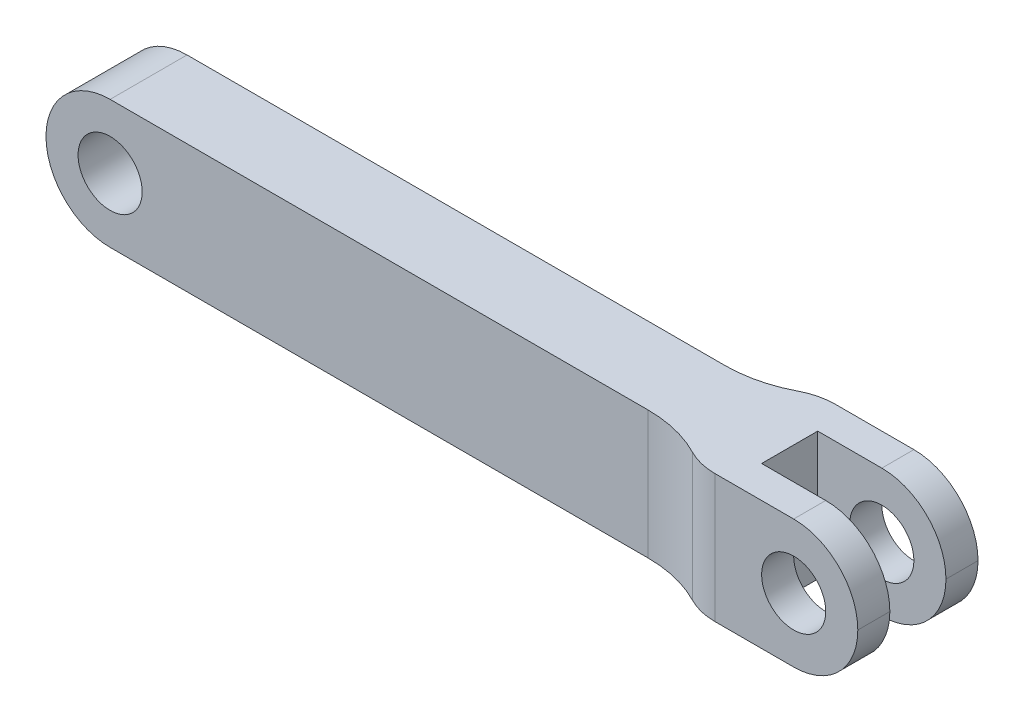
ISO-10303-21;
HEADER;
FILE_DESCRIPTION(('STEP AP214'),'2;1');
FILE_NAME('part.step','',(''),(''),'','','');
FILE_SCHEMA(('AUTOMOTIVE_DESIGN { 1 0 10303 214 1 1 1 1 }'));
ENDSEC;
DATA;
#1=APPLICATION_CONTEXT('core data for automotive mechanical design processes');
#2=APPLICATION_PROTOCOL_DEFINITION('international standard','automotive_design',2000,#1);
#3=PRODUCT_CONTEXT('',#1,'mechanical');
#4=PRODUCT('Part','Part','',(#3));
#5=PRODUCT_RELATED_PRODUCT_CATEGORY('part','',(#4));
#6=PRODUCT_DEFINITION_FORMATION('','',#4);
#7=PRODUCT_DEFINITION_CONTEXT('part definition',#1,'design');
#8=PRODUCT_DEFINITION('design','',#6,#7);
#9=PRODUCT_DEFINITION_SHAPE('','',#8);
#10=(LENGTH_UNIT() NAMED_UNIT(*) SI_UNIT(.MILLI.,.METRE.));
#11=(NAMED_UNIT(*) PLANE_ANGLE_UNIT() SI_UNIT($,.RADIAN.));
#12=(NAMED_UNIT(*) SI_UNIT($,.STERADIAN.) SOLID_ANGLE_UNIT());
#13=UNCERTAINTY_MEASURE_WITH_UNIT(LENGTH_MEASURE(1.E-05),#10,'distance_accuracy_value','');
#14=(GEOMETRIC_REPRESENTATION_CONTEXT(3) GLOBAL_UNCERTAINTY_ASSIGNED_CONTEXT((#13)) GLOBAL_UNIT_ASSIGNED_CONTEXT((#10,
#11,#12)) REPRESENTATION_CONTEXT('',''));
#15=CARTESIAN_POINT('',(0.,0.,0.));
#16=DIRECTION('',(0.,0.,1.));
#17=DIRECTION('',(1.,0.,0.));
#18=AXIS2_PLACEMENT_3D('',#15,#16,#17);
#19=CARTESIAN_POINT('',(0.,0.,12.));
#20=DIRECTION('',(0.,0.,1.));
#21=DIRECTION('',(1.,0.,0.));
#22=AXIS2_PLACEMENT_3D('',#19,#20,#21);
#23=PLANE('',#22);
#24=CARTESIAN_POINT('',(0.,0.,12.));
#25=DIRECTION('',(0.,0.,1.));
#26=DIRECTION('',(1.,0.,0.));
#27=AXIS2_PLACEMENT_3D('',#24,#25,#26);
#28=CIRCLE('',#27,5.);
#29=CARTESIAN_POINT('',(5.,0.,12.));
#30=VERTEX_POINT('',#29);
#31=EDGE_CURVE('E198',#30,#30,#28,.T.);
#32=ORIENTED_EDGE('',*,*,#31,.F.);
#33=EDGE_LOOP('',(#32));
#34=FACE_BOUND('',#33,.T.);
#35=DIRECTION('',(1.,0.,0.));
#36=VECTOR('',#35,1.);
#37=CARTESIAN_POINT('',(0.,-10.,12.));
#38=LINE('',#37,#36);
#39=CARTESIAN_POINT('',(0.,-10.,12.));
#40=VERTEX_POINT('',#39);
#41=CARTESIAN_POINT('',(83.8820246897198,-10.,12.));
#42=VERTEX_POINT('',#41);
#43=EDGE_CURVE('E207',#40,#42,#38,.T.);
#44=ORIENTED_EDGE('',*,*,#43,.T.);
#45=DIRECTION('',(0.,1.,0.));
#46=VECTOR('',#45,1.);
#47=CARTESIAN_POINT('',(83.8820246897198,10.,12.));
#48=LINE('',#47,#46);
#49=CARTESIAN_POINT('',(83.8820246897198,10.,12.));
#50=VERTEX_POINT('',#49);
#51=EDGE_CURVE('E225',#42,#50,#48,.T.);
#52=ORIENTED_EDGE('',*,*,#51,.T.);
#53=DIRECTION('',(-1.,0.,0.));
#54=VECTOR('',#53,1.);
#55=CARTESIAN_POINT('',(0.,10.,12.));
#56=LINE('',#55,#54);
#57=CARTESIAN_POINT('',(0.,10.,12.));
#58=VERTEX_POINT('',#57);
#59=EDGE_CURVE('E211',#50,#58,#56,.T.);
#60=ORIENTED_EDGE('',*,*,#59,.T.);
#61=CARTESIAN_POINT('',(0.,0.,12.));
#62=DIRECTION('',(0.,0.,1.));
#63=DIRECTION('',(1.,0.,0.));
#64=AXIS2_PLACEMENT_3D('',#61,#62,#63);
#65=CIRCLE('',#64,10.);
#66=EDGE_CURVE('E204',#58,#40,#65,.T.);
#67=ORIENTED_EDGE('',*,*,#66,.T.);
#68=EDGE_LOOP('',(#44,#52,#60,#67));
#69=FACE_BOUND('',#68,.T.);
#70=ADVANCED_FACE('F37',(#34,#69),#23,.T.);
#71=CARTESIAN_POINT('',(0.,0.,0.));
#72=DIRECTION('',(0.,0.,1.));
#73=DIRECTION('',(1.,0.,0.));
#74=AXIS2_PLACEMENT_3D('',#71,#72,#73);
#75=PLANE('',#74);
#76=CARTESIAN_POINT('',(0.,0.,0.));
#77=DIRECTION('',(0.,0.,1.));
#78=DIRECTION('',(1.,0.,0.));
#79=AXIS2_PLACEMENT_3D('',#76,#77,#78);
#80=CIRCLE('',#79,5.);
#81=CARTESIAN_POINT('',(5.,0.,0.));
#82=VERTEX_POINT('',#81);
#83=EDGE_CURVE('E197',#82,#82,#80,.T.);
#84=ORIENTED_EDGE('',*,*,#83,.T.);
#85=EDGE_LOOP('',(#84));
#86=FACE_BOUND('',#85,.T.);
#87=DIRECTION('',(-1.,0.,0.));
#88=VECTOR('',#87,1.);
#89=CARTESIAN_POINT('',(0.,10.,0.));
#90=LINE('',#89,#88);
#91=CARTESIAN_POINT('',(83.8820246897198,10.,0.));
#92=VERTEX_POINT('',#91);
#93=CARTESIAN_POINT('',(0.,10.,0.));
#94=VERTEX_POINT('',#93);
#95=EDGE_CURVE('E208',#92,#94,#90,.T.);
#96=ORIENTED_EDGE('',*,*,#95,.F.);
#97=DIRECTION('',(0.,1.,0.));
#98=VECTOR('',#97,1.);
#99=CARTESIAN_POINT('',(83.8820246897198,0.,0.));
#100=LINE('',#99,#98);
#101=CARTESIAN_POINT('',(83.8820246897198,-10.,0.));
#102=VERTEX_POINT('',#101);
#103=EDGE_CURVE('E228',#92,#102,#100,.F.);
#104=ORIENTED_EDGE('',*,*,#103,.T.);
#105=DIRECTION('',(1.,0.,0.));
#106=VECTOR('',#105,1.);
#107=CARTESIAN_POINT('',(0.,-10.,0.));
#108=LINE('',#107,#106);
#109=CARTESIAN_POINT('',(0.,-10.,0.));
#110=VERTEX_POINT('',#109);
#111=EDGE_CURVE('E216',#110,#102,#108,.T.);
#112=ORIENTED_EDGE('',*,*,#111,.F.);
#113=CARTESIAN_POINT('',(0.,0.,0.));
#114=DIRECTION('',(0.,0.,1.));
#115=DIRECTION('',(1.,0.,0.));
#116=AXIS2_PLACEMENT_3D('',#113,#114,#115);
#117=CIRCLE('',#116,10.);
#118=EDGE_CURVE('E201',#94,#110,#117,.T.);
#119=ORIENTED_EDGE('',*,*,#118,.F.);
#120=EDGE_LOOP('',(#96,#104,#112,#119));
#121=FACE_BOUND('',#120,.T.);
#122=ADVANCED_FACE('F323',(#86,#121),#75,.F.);
#123=CARTESIAN_POINT('',(0.,0.,12.));
#124=DIRECTION('',(0.,0.,-1.));
#125=DIRECTION('',(-1.,0.,0.));
#126=AXIS2_PLACEMENT_3D('',#123,#124,#125);
#127=CYLINDRICAL_SURFACE('',#126,10.);
#128=ORIENTED_EDGE('',*,*,#118,.T.);
#129=DIRECTION('',(0.,0.,-1.));
#130=VECTOR('',#129,1.);
#131=CARTESIAN_POINT('',(0.,-10.,12.));
#132=LINE('',#131,#130);
#133=EDGE_CURVE('E163',#40,#110,#132,.T.);
#134=ORIENTED_EDGE('',*,*,#133,.F.);
#135=ORIENTED_EDGE('',*,*,#66,.F.);
#136=DIRECTION('',(0.,0.,-1.));
#137=VECTOR('',#136,1.);
#138=CARTESIAN_POINT('',(0.,10.,12.));
#139=LINE('',#138,#137);
#140=EDGE_CURVE('E213',#58,#94,#139,.T.);
#141=ORIENTED_EDGE('',*,*,#140,.T.);
#142=EDGE_LOOP('',(#128,#134,#135,#141));
#143=FACE_BOUND('',#142,.T.);
#144=ADVANCED_FACE('F328',(#143),#127,.T.);
#145=CARTESIAN_POINT('',(0.,-10.,12.));
#146=DIRECTION('',(0.,1.,0.));
#147=DIRECTION('',(0.,0.,1.));
#148=AXIS2_PLACEMENT_3D('',#145,#146,#147);
#149=PLANE('',#148);
#150=DIRECTION('',(1.,0.,0.));
#151=VECTOR('',#150,1.);
#152=CARTESIAN_POINT('',(95.,-10.,10.375));
#153=LINE('',#152,#151);
#154=CARTESIAN_POINT('',(100.,-10.,10.375));
#155=VERTEX_POINT('',#154);
#156=CARTESIAN_POINT('',(110.,-10.,10.375));
#157=VERTEX_POINT('',#156);
#158=EDGE_CURVE('E156',#155,#157,#153,.T.);
#159=ORIENTED_EDGE('',*,*,#158,.T.);
#160=DIRECTION('',(0.,0.,-1.));
#161=VECTOR('',#160,1.);
#162=CARTESIAN_POINT('',(110.,-10.,15.375));
#163=LINE('',#162,#161);
#164=CARTESIAN_POINT('',(110.,-10.,15.375));
#165=VERTEX_POINT('',#164);
#166=EDGE_CURVE('E263',#157,#165,#163,.F.);
#167=ORIENTED_EDGE('',*,*,#166,.T.);
#168=DIRECTION('',(1.,0.,0.));
#169=VECTOR('',#168,1.);
#170=CARTESIAN_POINT('',(95.,-10.,15.375));
#171=LINE('',#170,#169);
#172=CARTESIAN_POINT('',(97.7062561330949,-10.,15.375));
#173=VERTEX_POINT('',#172);
#174=EDGE_CURVE('E177',#173,#165,#171,.T.);
#175=ORIENTED_EDGE('',*,*,#174,.F.);
#176=CARTESIAN_POINT('',(97.7062561330949,-10.,5.375));
#177=DIRECTION('',(0.,1.,0.));
#178=DIRECTION('',(0.,0.,1.));
#179=AXIS2_PLACEMENT_3D('',#176,#177,#178);
#180=CIRCLE('',#179,10.);
#181=CARTESIAN_POINT('',(93.0981789853032,-10.,14.25));
#182=VERTEX_POINT('',#181);
#183=EDGE_CURVE('E245',#173,#182,#180,.F.);
#184=ORIENTED_EDGE('',*,*,#183,.T.);
#185=CARTESIAN_POINT('',(83.8820246897198,-10.,32.));
#186=DIRECTION('',(0.,1.,0.));
#187=DIRECTION('',(0.,0.,1.));
#188=AXIS2_PLACEMENT_3D('',#185,#186,#187);
#189=CIRCLE('',#188,20.);
#190=EDGE_CURVE('E233',#182,#42,#189,.T.);
#191=ORIENTED_EDGE('',*,*,#190,.T.);
#192=ORIENTED_EDGE('',*,*,#43,.F.);
#193=ORIENTED_EDGE('',*,*,#133,.T.);
#194=ORIENTED_EDGE('',*,*,#111,.T.);
#195=CARTESIAN_POINT('',(83.8820246897198,-10.,-20.));
#196=DIRECTION('',(0.,1.,0.));
#197=DIRECTION('',(0.,0.,1.));
#198=AXIS2_PLACEMENT_3D('',#195,#196,#197);
#199=CIRCLE('',#198,20.);
#200=CARTESIAN_POINT('',(93.0981789853032,-10.,-2.25));
#201=VERTEX_POINT('',#200);
#202=EDGE_CURVE('E237',#102,#201,#199,.T.);
#203=ORIENTED_EDGE('',*,*,#202,.T.);
#204=CARTESIAN_POINT('',(97.7062561330949,-10.,6.625));
#205=DIRECTION('',(0.,1.,0.));
#206=DIRECTION('',(0.,0.,1.));
#207=AXIS2_PLACEMENT_3D('',#204,#205,#206);
#208=CIRCLE('',#207,10.);
#209=CARTESIAN_POINT('',(97.7062561330949,-10.,-3.375));
#210=VERTEX_POINT('',#209);
#211=EDGE_CURVE('E243',#201,#210,#208,.F.);
#212=ORIENTED_EDGE('',*,*,#211,.T.);
#213=DIRECTION('',(1.,0.,0.));
#214=VECTOR('',#213,1.);
#215=CARTESIAN_POINT('',(95.,-10.,-3.375));
#216=LINE('',#215,#214);
#217=CARTESIAN_POINT('',(110.,-10.,-3.375));
#218=VERTEX_POINT('',#217);
#219=EDGE_CURVE('E192',#210,#218,#216,.T.);
#220=ORIENTED_EDGE('',*,*,#219,.T.);
#221=DIRECTION('',(0.,0.,-1.));
#222=VECTOR('',#221,1.);
#223=CARTESIAN_POINT('',(110.,-10.,1.625));
#224=LINE('',#223,#222);
#225=CARTESIAN_POINT('',(110.,-10.,1.625));
#226=VERTEX_POINT('',#225);
#227=EDGE_CURVE('E261',#218,#226,#224,.F.);
#228=ORIENTED_EDGE('',*,*,#227,.T.);
#229=DIRECTION('',(1.,0.,0.));
#230=VECTOR('',#229,1.);
#231=CARTESIAN_POINT('',(95.,-10.,1.625));
#232=LINE('',#231,#230);
#233=CARTESIAN_POINT('',(100.,-10.,1.625));
#234=VERTEX_POINT('',#233);
#235=EDGE_CURVE('E159',#234,#226,#232,.T.);
#236=ORIENTED_EDGE('',*,*,#235,.F.);
#237=DIRECTION('',(0.,0.,-1.));
#238=VECTOR('',#237,1.);
#239=CARTESIAN_POINT('',(100.,-10.,12.));
#240=LINE('',#239,#238);
#241=EDGE_CURVE('E151',#155,#234,#240,.T.);
#242=ORIENTED_EDGE('',*,*,#241,.F.);
#243=EDGE_LOOP('',(#159,#167,#175,#184,#191,#192,#193,#194,#203,#212,#220,#228,#236,#242));
#244=FACE_BOUND('',#243,.T.);
#245=ADVANCED_FACE('F153',(#244),#149,.F.);
#246=CARTESIAN_POINT('',(100.,-10.,12.));
#247=DIRECTION('',(-1.,0.,0.));
#248=DIRECTION('',(0.,0.,1.));
#249=AXIS2_PLACEMENT_3D('',#246,#247,#248);
#250=PLANE('',#249);
#251=DIRECTION('',(0.,0.,-1.));
#252=VECTOR('',#251,1.);
#253=CARTESIAN_POINT('',(100.,10.,12.));
#254=LINE('',#253,#252);
#255=CARTESIAN_POINT('',(100.,10.,10.375));
#256=VERTEX_POINT('',#255);
#257=CARTESIAN_POINT('',(100.,10.,1.625));
#258=VERTEX_POINT('',#257);
#259=EDGE_CURVE('E164',#256,#258,#254,.T.);
#260=ORIENTED_EDGE('',*,*,#259,.F.);
#261=DIRECTION('',(0.,-1.,0.));
#262=VECTOR('',#261,1.);
#263=CARTESIAN_POINT('',(100.,-10.,10.375));
#264=LINE('',#263,#262);
#265=EDGE_CURVE('E167',#256,#155,#264,.T.);
#266=ORIENTED_EDGE('',*,*,#265,.T.);
#267=ORIENTED_EDGE('',*,*,#241,.T.);
#268=DIRECTION('',(0.,1.,0.));
#269=VECTOR('',#268,1.);
#270=CARTESIAN_POINT('',(100.,-10.,1.625));
#271=LINE('',#270,#269);
#272=EDGE_CURVE('E189',#234,#258,#271,.T.);
#273=ORIENTED_EDGE('',*,*,#272,.T.);
#274=EDGE_LOOP('',(#260,#266,#267,#273));
#275=FACE_BOUND('',#274,.T.);
#276=ADVANCED_FACE('F168',(#275),#250,.F.);
#277=CARTESIAN_POINT('',(0.,10.,12.));
#278=DIRECTION('',(0.,-1.,0.));
#279=DIRECTION('',(0.,0.,-1.));
#280=AXIS2_PLACEMENT_3D('',#277,#278,#279);
#281=PLANE('',#280);
#282=DIRECTION('',(1.,0.,0.));
#283=VECTOR('',#282,1.);
#284=CARTESIAN_POINT('',(95.,10.,15.375));
#285=LINE('',#284,#283);
#286=CARTESIAN_POINT('',(97.7062561330949,10.,15.375));
#287=VERTEX_POINT('',#286);
#288=CARTESIAN_POINT('',(110.,10.,15.375));
#289=VERTEX_POINT('',#288);
#290=EDGE_CURVE('E172',#287,#289,#285,.T.);
#291=ORIENTED_EDGE('',*,*,#290,.T.);
#292=DIRECTION('',(0.,0.,1.));
#293=VECTOR('',#292,1.);
#294=CARTESIAN_POINT('',(110.,10.,10.375));
#295=LINE('',#294,#293);
#296=CARTESIAN_POINT('',(110.,10.,10.375));
#297=VERTEX_POINT('',#296);
#298=EDGE_CURVE('E271',#289,#297,#295,.F.);
#299=ORIENTED_EDGE('',*,*,#298,.T.);
#300=DIRECTION('',(1.,0.,0.));
#301=VECTOR('',#300,1.);
#302=CARTESIAN_POINT('',(95.,10.,10.375));
#303=LINE('',#302,#301);
#304=EDGE_CURVE('E178',#256,#297,#303,.T.);
#305=ORIENTED_EDGE('',*,*,#304,.F.);
#306=ORIENTED_EDGE('',*,*,#259,.T.);
#307=DIRECTION('',(1.,0.,0.));
#308=VECTOR('',#307,1.);
#309=CARTESIAN_POINT('',(95.,10.,1.625));
#310=LINE('',#309,#308);
#311=CARTESIAN_POINT('',(110.,10.,1.625));
#312=VERTEX_POINT('',#311);
#313=EDGE_CURVE('E186',#258,#312,#310,.T.);
#314=ORIENTED_EDGE('',*,*,#313,.T.);
#315=DIRECTION('',(0.,0.,1.));
#316=VECTOR('',#315,1.);
#317=CARTESIAN_POINT('',(110.,10.,-3.375));
#318=LINE('',#317,#316);
#319=CARTESIAN_POINT('',(110.,10.,-3.375));
#320=VERTEX_POINT('',#319);
#321=EDGE_CURVE('E269',#312,#320,#318,.F.);
#322=ORIENTED_EDGE('',*,*,#321,.T.);
#323=DIRECTION('',(1.,0.,0.));
#324=VECTOR('',#323,1.);
#325=CARTESIAN_POINT('',(95.,10.,-3.375));
#326=LINE('',#325,#324);
#327=CARTESIAN_POINT('',(97.7062561330949,10.,-3.375));
#328=VERTEX_POINT('',#327);
#329=EDGE_CURVE('E190',#328,#320,#326,.T.);
#330=ORIENTED_EDGE('',*,*,#329,.F.);
#331=CARTESIAN_POINT('',(97.7062561330949,10.,6.625));
#332=DIRECTION('',(0.,-1.,0.));
#333=DIRECTION('',(0.,0.,-1.));
#334=AXIS2_PLACEMENT_3D('',#331,#332,#333);
#335=CIRCLE('',#334,10.);
#336=CARTESIAN_POINT('',(93.0981789853032,10.,-2.25));
#337=VERTEX_POINT('',#336);
#338=EDGE_CURVE('E249',#328,#337,#335,.F.);
#339=ORIENTED_EDGE('',*,*,#338,.T.);
#340=CARTESIAN_POINT('',(83.8820246897198,10.,-20.));
#341=DIRECTION('',(0.,-1.,0.));
#342=DIRECTION('',(0.,0.,-1.));
#343=AXIS2_PLACEMENT_3D('',#340,#341,#342);
#344=CIRCLE('',#343,20.);
#345=EDGE_CURVE('E235',#337,#92,#344,.T.);
#346=ORIENTED_EDGE('',*,*,#345,.T.);
#347=ORIENTED_EDGE('',*,*,#95,.T.);
#348=ORIENTED_EDGE('',*,*,#140,.F.);
#349=ORIENTED_EDGE('',*,*,#59,.F.);
#350=CARTESIAN_POINT('',(83.8820246897198,10.,32.));
#351=DIRECTION('',(0.,-1.,0.));
#352=DIRECTION('',(0.,0.,-1.));
#353=AXIS2_PLACEMENT_3D('',#350,#351,#352);
#354=CIRCLE('',#353,20.);
#355=CARTESIAN_POINT('',(93.0981789853032,10.,14.25));
#356=VERTEX_POINT('',#355);
#357=EDGE_CURVE('E230',#50,#356,#354,.T.);
#358=ORIENTED_EDGE('',*,*,#357,.T.);
#359=CARTESIAN_POINT('',(97.7062561330949,10.,5.375));
#360=DIRECTION('',(0.,-1.,0.));
#361=DIRECTION('',(0.,0.,-1.));
#362=AXIS2_PLACEMENT_3D('',#359,#360,#361);
#363=CIRCLE('',#362,10.);
#364=EDGE_CURVE('E251',#356,#287,#363,.F.);
#365=ORIENTED_EDGE('',*,*,#364,.T.);
#366=EDGE_LOOP('',(#291,#299,#305,#306,#314,#322,#330,#339,#346,#347,#348,#349,#358,#365));
#367=FACE_BOUND('',#366,.T.);
#368=ADVANCED_FACE('F296',(#367),#281,.F.);
#369=CARTESIAN_POINT('',(0.,0.,12.));
#370=DIRECTION('',(0.,0.,-1.));
#371=DIRECTION('',(-1.,0.,0.));
#372=AXIS2_PLACEMENT_3D('',#369,#370,#371);
#373=CYLINDRICAL_SURFACE('',#372,5.);
#374=ORIENTED_EDGE('',*,*,#31,.T.);
#375=EDGE_LOOP('',(#374));
#376=FACE_BOUND('',#375,.T.);
#377=ORIENTED_EDGE('',*,*,#83,.F.);
#378=EDGE_LOOP('',(#377));
#379=FACE_BOUND('',#378,.T.);
#380=ADVANCED_FACE('F361',(#376,#379),#373,.F.);
#381=CARTESIAN_POINT('',(95.,10.,1.625));
#382=DIRECTION('',(0.,0.,1.));
#383=DIRECTION('',(0.,-1.,0.));
#384=AXIS2_PLACEMENT_3D('',#381,#382,#383);
#385=PLANE('',#384);
#386=CARTESIAN_POINT('',(110.,0.,1.625));
#387=DIRECTION('',(0.,0.,1.));
#388=DIRECTION('',(0.,-1.,0.));
#389=AXIS2_PLACEMENT_3D('',#386,#387,#388);
#390=CIRCLE('',#389,5.00000000000002);
#391=CARTESIAN_POINT('',(110.,-5.00000000000002,1.625));
#392=VERTEX_POINT('',#391);
#393=EDGE_CURVE('E280',#392,#392,#390,.T.);
#394=ORIENTED_EDGE('',*,*,#393,.F.);
#395=EDGE_LOOP('',(#394));
#396=FACE_BOUND('',#395,.T.);
#397=ORIENTED_EDGE('',*,*,#235,.T.);
#398=CARTESIAN_POINT('',(110.,0.,1.625));
#399=DIRECTION('',(0.,0.,1.));
#400=DIRECTION('',(0.,-1.,0.));
#401=AXIS2_PLACEMENT_3D('',#398,#399,#400);
#402=CIRCLE('',#401,10.);
#403=CARTESIAN_POINT('',(120.,0.,1.625));
#404=VERTEX_POINT('',#403);
#405=EDGE_CURVE('E11',#226,#404,#402,.T.);
#406=ORIENTED_EDGE('',*,*,#405,.T.);
#407=CARTESIAN_POINT('',(110.,0.,1.625));
#408=DIRECTION('',(0.,0.,1.));
#409=DIRECTION('',(0.,-1.,0.));
#410=AXIS2_PLACEMENT_3D('',#407,#408,#409);
#411=CIRCLE('',#410,10.);
#412=EDGE_CURVE('E46',#404,#312,#411,.T.);
#413=ORIENTED_EDGE('',*,*,#412,.T.);
#414=ORIENTED_EDGE('',*,*,#313,.F.);
#415=ORIENTED_EDGE('',*,*,#272,.F.);
#416=EDGE_LOOP('',(#397,#406,#413,#414,#415));
#417=FACE_BOUND('',#416,.T.);
#418=ADVANCED_FACE('F306',(#396,#417),#385,.T.);
#419=CARTESIAN_POINT('',(95.,10.,-3.375));
#420=DIRECTION('',(0.,0.,-1.));
#421=DIRECTION('',(0.,1.,0.));
#422=AXIS2_PLACEMENT_3D('',#419,#420,#421);
#423=PLANE('',#422);
#424=CARTESIAN_POINT('',(110.,0.,-3.375));
#425=DIRECTION('',(0.,0.,-1.));
#426=DIRECTION('',(0.,1.,0.));
#427=AXIS2_PLACEMENT_3D('',#424,#425,#426);
#428=CIRCLE('',#427,5.00000000000002);
#429=CARTESIAN_POINT('',(110.,5.00000000000002,-3.375));
#430=VERTEX_POINT('',#429);
#431=EDGE_CURVE('E579',#430,#430,#428,.T.);
#432=ORIENTED_EDGE('',*,*,#431,.F.);
#433=EDGE_LOOP('',(#432));
#434=FACE_BOUND('',#433,.T.);
#435=CARTESIAN_POINT('',(110.,0.,-3.375));
#436=DIRECTION('',(0.,0.,-1.));
#437=DIRECTION('',(0.,1.,0.));
#438=AXIS2_PLACEMENT_3D('',#435,#436,#437);
#439=CIRCLE('',#438,10.);
#440=CARTESIAN_POINT('',(120.,0.,-3.375));
#441=VERTEX_POINT('',#440);
#442=EDGE_CURVE('E60',#320,#441,#439,.T.);
#443=ORIENTED_EDGE('',*,*,#442,.T.);
#444=CARTESIAN_POINT('',(110.,0.,-3.375));
#445=DIRECTION('',(0.,0.,-1.));
#446=DIRECTION('',(0.,1.,0.));
#447=AXIS2_PLACEMENT_3D('',#444,#445,#446);
#448=CIRCLE('',#447,10.);
#449=EDGE_CURVE('E274',#441,#218,#448,.T.);
#450=ORIENTED_EDGE('',*,*,#449,.T.);
#451=ORIENTED_EDGE('',*,*,#219,.F.);
#452=DIRECTION('',(0.,-1.,0.));
#453=VECTOR('',#452,1.);
#454=CARTESIAN_POINT('',(97.7062561330949,10.,-3.375));
#455=LINE('',#454,#453);
#456=EDGE_CURVE('E253',#210,#328,#455,.F.);
#457=ORIENTED_EDGE('',*,*,#456,.T.);
#458=ORIENTED_EDGE('',*,*,#329,.T.);
#459=EDGE_LOOP('',(#443,#450,#451,#457,#458));
#460=FACE_BOUND('',#459,.T.);
#461=ADVANCED_FACE('F309',(#434,#460),#423,.T.);
#462=CARTESIAN_POINT('',(95.,10.,10.375));
#463=DIRECTION('',(0.,0.,-1.));
#464=DIRECTION('',(0.,1.,0.));
#465=AXIS2_PLACEMENT_3D('',#462,#463,#464);
#466=PLANE('',#465);
#467=CARTESIAN_POINT('',(110.,0.,10.375));
#468=DIRECTION('',(0.,0.,-1.));
#469=DIRECTION('',(0.,1.,0.));
#470=AXIS2_PLACEMENT_3D('',#467,#468,#469);
#471=CIRCLE('',#470,5.00000000000002);
#472=CARTESIAN_POINT('',(110.,5.00000000000002,10.375));
#473=VERTEX_POINT('',#472);
#474=EDGE_CURVE('E284',#473,#473,#471,.T.);
#475=ORIENTED_EDGE('',*,*,#474,.F.);
#476=EDGE_LOOP('',(#475));
#477=FACE_BOUND('',#476,.T.);
#478=CARTESIAN_POINT('',(110.,0.,10.375));
#479=DIRECTION('',(0.,0.,-1.));
#480=DIRECTION('',(0.,1.,0.));
#481=AXIS2_PLACEMENT_3D('',#478,#479,#480);
#482=CIRCLE('',#481,10.);
#483=CARTESIAN_POINT('',(120.,0.,10.375));
#484=VERTEX_POINT('',#483);
#485=EDGE_CURVE('E258',#297,#484,#482,.T.);
#486=ORIENTED_EDGE('',*,*,#485,.T.);
#487=CARTESIAN_POINT('',(110.,0.,10.375));
#488=DIRECTION('',(0.,0.,-1.));
#489=DIRECTION('',(0.,1.,0.));
#490=AXIS2_PLACEMENT_3D('',#487,#488,#489);
#491=CIRCLE('',#490,10.);
#492=EDGE_CURVE('E176',#484,#157,#491,.T.);
#493=ORIENTED_EDGE('',*,*,#492,.T.);
#494=ORIENTED_EDGE('',*,*,#158,.F.);
#495=ORIENTED_EDGE('',*,*,#265,.F.);
#496=ORIENTED_EDGE('',*,*,#304,.T.);
#497=EDGE_LOOP('',(#486,#493,#494,#495,#496));
#498=FACE_BOUND('',#497,.T.);
#499=ADVANCED_FACE('F174',(#477,#498),#466,.T.);
#500=CARTESIAN_POINT('',(95.,10.,15.375));
#501=DIRECTION('',(0.,0.,1.));
#502=DIRECTION('',(1.,0.,0.));
#503=AXIS2_PLACEMENT_3D('',#500,#501,#502);
#504=PLANE('',#503);
#505=CARTESIAN_POINT('',(110.,0.,15.375));
#506=DIRECTION('',(0.,0.,-1.));
#507=DIRECTION('',(0.,1.,0.));
#508=AXIS2_PLACEMENT_3D('',#505,#506,#507);
#509=CIRCLE('',#508,5.00000000000002);
#510=CARTESIAN_POINT('',(110.,5.00000000000002,15.375));
#511=VERTEX_POINT('',#510);
#512=EDGE_CURVE('E289',#511,#511,#509,.T.);
#513=ORIENTED_EDGE('',*,*,#512,.T.);
#514=EDGE_LOOP('',(#513));
#515=FACE_BOUND('',#514,.T.);
#516=ORIENTED_EDGE('',*,*,#174,.T.);
#517=CARTESIAN_POINT('',(110.,0.,15.375));
#518=DIRECTION('',(0.,0.,1.));
#519=DIRECTION('',(1.,0.,0.));
#520=AXIS2_PLACEMENT_3D('',#517,#518,#519);
#521=CIRCLE('',#520,10.);
#522=CARTESIAN_POINT('',(120.,0.,15.375));
#523=VERTEX_POINT('',#522);
#524=EDGE_CURVE('E267',#165,#523,#521,.T.);
#525=ORIENTED_EDGE('',*,*,#524,.T.);
#526=CARTESIAN_POINT('',(110.,0.,15.375));
#527=DIRECTION('',(0.,0.,1.));
#528=DIRECTION('',(1.,0.,0.));
#529=AXIS2_PLACEMENT_3D('',#526,#527,#528);
#530=CIRCLE('',#529,10.);
#531=EDGE_CURVE('E265',#523,#289,#530,.T.);
#532=ORIENTED_EDGE('',*,*,#531,.T.);
#533=ORIENTED_EDGE('',*,*,#290,.F.);
#534=DIRECTION('',(0.,1.,0.));
#535=VECTOR('',#534,1.);
#536=CARTESIAN_POINT('',(97.7062561330949,-10.,15.375));
#537=LINE('',#536,#535);
#538=EDGE_CURVE('E240',#287,#173,#537,.F.);
#539=ORIENTED_EDGE('',*,*,#538,.T.);
#540=EDGE_LOOP('',(#516,#525,#532,#533,#539));
#541=FACE_BOUND('',#540,.T.);
#542=ADVANCED_FACE('F340',(#515,#541),#504,.T.);
#543=CARTESIAN_POINT('',(83.8820246897198,0.,32.));
#544=DIRECTION('',(0.,-1.,0.));
#545=DIRECTION('',(0.,0.,-1.));
#546=AXIS2_PLACEMENT_3D('',#543,#544,#545);
#547=CYLINDRICAL_SURFACE('',#546,20.);
#548=ORIENTED_EDGE('',*,*,#190,.F.);
#549=DIRECTION('',(0.,-1.,0.));
#550=VECTOR('',#549,1.);
#551=CARTESIAN_POINT('',(93.0981789853032,0.,14.25));
#552=LINE('',#551,#550);
#553=EDGE_CURVE('E247',#182,#356,#552,.F.);
#554=ORIENTED_EDGE('',*,*,#553,.T.);
#555=ORIENTED_EDGE('',*,*,#357,.F.);
#556=ORIENTED_EDGE('',*,*,#51,.F.);
#557=EDGE_LOOP('',(#548,#554,#555,#556));
#558=FACE_BOUND('',#557,.T.);
#559=ADVANCED_FACE('F335',(#558),#547,.F.);
#560=CARTESIAN_POINT('',(83.8820246897198,0.,-20.));
#561=DIRECTION('',(0.,1.,0.));
#562=DIRECTION('',(0.,0.,1.));
#563=AXIS2_PLACEMENT_3D('',#560,#561,#562);
#564=CYLINDRICAL_SURFACE('',#563,20.);
#565=ORIENTED_EDGE('',*,*,#345,.F.);
#566=DIRECTION('',(0.,1.,0.));
#567=VECTOR('',#566,1.);
#568=CARTESIAN_POINT('',(93.0981789853032,0.,-2.25));
#569=LINE('',#568,#567);
#570=EDGE_CURVE('E256',#337,#201,#569,.F.);
#571=ORIENTED_EDGE('',*,*,#570,.T.);
#572=ORIENTED_EDGE('',*,*,#202,.F.);
#573=ORIENTED_EDGE('',*,*,#103,.F.);
#574=EDGE_LOOP('',(#565,#571,#572,#573));
#575=FACE_BOUND('',#574,.T.);
#576=ADVANCED_FACE('F320',(#575),#564,.F.);
#577=CARTESIAN_POINT('',(97.7062561330949,0.,5.375));
#578=DIRECTION('',(0.,-1.,0.));
#579=DIRECTION('',(0.,0.,-1.));
#580=AXIS2_PLACEMENT_3D('',#577,#578,#579);
#581=CYLINDRICAL_SURFACE('',#580,10.);
#582=ORIENTED_EDGE('',*,*,#364,.F.);
#583=ORIENTED_EDGE('',*,*,#553,.F.);
#584=ORIENTED_EDGE('',*,*,#183,.F.);
#585=ORIENTED_EDGE('',*,*,#538,.F.);
#586=EDGE_LOOP('',(#582,#583,#584,#585));
#587=FACE_BOUND('',#586,.T.);
#588=ADVANCED_FACE('F338',(#587),#581,.T.);
#589=CARTESIAN_POINT('',(97.7062561330949,0.,6.625));
#590=DIRECTION('',(0.,1.,0.));
#591=DIRECTION('',(0.,0.,1.));
#592=AXIS2_PLACEMENT_3D('',#589,#590,#591);
#593=CYLINDRICAL_SURFACE('',#592,10.);
#594=ORIENTED_EDGE('',*,*,#211,.F.);
#595=ORIENTED_EDGE('',*,*,#570,.F.);
#596=ORIENTED_EDGE('',*,*,#338,.F.);
#597=ORIENTED_EDGE('',*,*,#456,.F.);
#598=EDGE_LOOP('',(#594,#595,#596,#597));
#599=FACE_BOUND('',#598,.T.);
#600=ADVANCED_FACE('F314',(#599),#593,.T.);
#601=CARTESIAN_POINT('',(110.,0.,0.));
#602=DIRECTION('',(0.,0.,-1.));
#603=DIRECTION('',(-1.,0.,0.));
#604=AXIS2_PLACEMENT_3D('',#601,#602,#603);
#605=CYLINDRICAL_SURFACE('',#604,10.);
#606=ORIENTED_EDGE('',*,*,#298,.F.);
#607=ORIENTED_EDGE('',*,*,#531,.F.);
#608=DIRECTION('',(0.,0.,1.));
#609=VECTOR('',#608,1.);
#610=CARTESIAN_POINT('',(120.,0.,15.375));
#611=LINE('',#610,#609);
#612=EDGE_CURVE('E182',#484,#523,#611,.T.);
#613=ORIENTED_EDGE('',*,*,#612,.F.);
#614=ORIENTED_EDGE('',*,*,#485,.F.);
#615=EDGE_LOOP('',(#606,#607,#613,#614));
#616=FACE_BOUND('',#615,.T.);
#617=ADVANCED_FACE('F303',(#616),#605,.T.);
#618=CARTESIAN_POINT('',(110.,0.,0.));
#619=DIRECTION('',(0.,0.,1.));
#620=DIRECTION('',(1.,0.,0.));
#621=AXIS2_PLACEMENT_3D('',#618,#619,#620);
#622=CYLINDRICAL_SURFACE('',#621,10.);
#623=ORIENTED_EDGE('',*,*,#524,.F.);
#624=ORIENTED_EDGE('',*,*,#166,.F.);
#625=ORIENTED_EDGE('',*,*,#492,.F.);
#626=ORIENTED_EDGE('',*,*,#612,.T.);
#627=EDGE_LOOP('',(#623,#624,#625,#626));
#628=FACE_BOUND('',#627,.T.);
#629=ADVANCED_FACE('F341',(#628),#622,.T.);
#630=CARTESIAN_POINT('',(110.,0.,0.));
#631=DIRECTION('',(0.,0.,-1.));
#632=DIRECTION('',(-1.,0.,0.));
#633=AXIS2_PLACEMENT_3D('',#630,#631,#632);
#634=CYLINDRICAL_SURFACE('',#633,10.);
#635=ORIENTED_EDGE('',*,*,#321,.F.);
#636=ORIENTED_EDGE('',*,*,#412,.F.);
#637=DIRECTION('',(0.,0.,1.));
#638=VECTOR('',#637,1.);
#639=CARTESIAN_POINT('',(120.,0.,1.625));
#640=LINE('',#639,#638);
#641=EDGE_CURVE('E41',#441,#404,#640,.T.);
#642=ORIENTED_EDGE('',*,*,#641,.F.);
#643=ORIENTED_EDGE('',*,*,#442,.F.);
#644=EDGE_LOOP('',(#635,#636,#642,#643));
#645=FACE_BOUND('',#644,.T.);
#646=ADVANCED_FACE('F39',(#645),#634,.T.);
#647=CARTESIAN_POINT('',(110.,0.,0.));
#648=DIRECTION('',(0.,0.,1.));
#649=DIRECTION('',(1.,0.,0.));
#650=AXIS2_PLACEMENT_3D('',#647,#648,#649);
#651=CYLINDRICAL_SURFACE('',#650,10.);
#652=ORIENTED_EDGE('',*,*,#405,.F.);
#653=ORIENTED_EDGE('',*,*,#227,.F.);
#654=ORIENTED_EDGE('',*,*,#449,.F.);
#655=ORIENTED_EDGE('',*,*,#641,.T.);
#656=EDGE_LOOP('',(#652,#653,#654,#655));
#657=FACE_BOUND('',#656,.T.);
#658=ADVANCED_FACE('F348',(#657),#651,.T.);
#659=CARTESIAN_POINT('',(110.,0.,15.375));
#660=DIRECTION('',(0.,0.,-1.));
#661=DIRECTION('',(0.,1.,0.));
#662=AXIS2_PLACEMENT_3D('',#659,#660,#661);
#663=CYLINDRICAL_SURFACE('',#662,5.00000000000002);
#664=ORIENTED_EDGE('',*,*,#474,.T.);
#665=EDGE_LOOP('',(#664));
#666=FACE_BOUND('',#665,.T.);
#667=ORIENTED_EDGE('',*,*,#512,.F.);
#668=EDGE_LOOP('',(#667));
#669=FACE_BOUND('',#668,.T.);
#670=ADVANCED_FACE('F412',(#666,#669),#663,.F.);
#671=ORIENTED_EDGE('',*,*,#393,.T.);
#672=EDGE_LOOP('',(#671));
#673=FACE_BOUND('',#672,.T.);
#674=ORIENTED_EDGE('',*,*,#431,.T.);
#675=EDGE_LOOP('',(#674));
#676=FACE_BOUND('',#675,.T.);
#677=ADVANCED_FACE('F462',(#673,#676),#663,.F.);
#678=CLOSED_SHELL('',(#70,#122,#144,#245,#276,#368,#380,#418,#461,#499,#542,#559,#576,#588,#600,
#617,#629,#646,#658,#670,#677));
#679=MANIFOLD_SOLID_BREP('B2',#678);
#680=ADVANCED_BREP_SHAPE_REPRESENTATION('',(#18,#679),#14);
#681=SHAPE_DEFINITION_REPRESENTATION(#9,#680);
ENDSEC;
END-ISO-10303-21;
